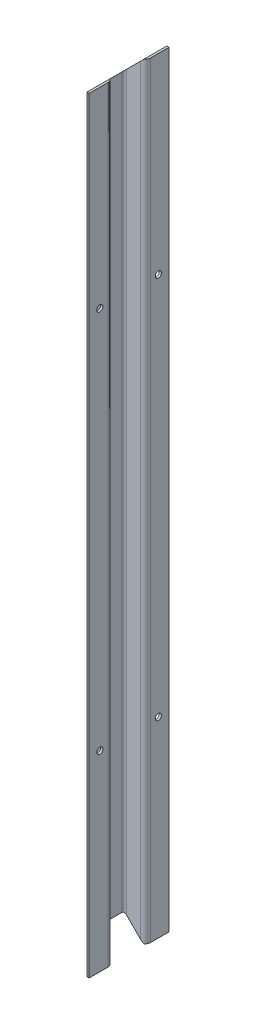
ISO-10303-21;
HEADER;
FILE_DESCRIPTION(('STEP AP214'),'2;1');
FILE_NAME('part.step','',(''),(''),'','','');
FILE_SCHEMA(('AUTOMOTIVE_DESIGN { 1 0 10303 214 1 1 1 1 }'));
ENDSEC;
DATA;
#1=APPLICATION_CONTEXT('core data for automotive mechanical design processes');
#2=APPLICATION_PROTOCOL_DEFINITION('international standard','automotive_design',2000,#1);
#3=PRODUCT_CONTEXT('',#1,'mechanical');
#4=PRODUCT('Part','Part','',(#3));
#5=PRODUCT_RELATED_PRODUCT_CATEGORY('part','',(#4));
#6=PRODUCT_DEFINITION_FORMATION('','',#4);
#7=PRODUCT_DEFINITION_CONTEXT('part definition',#1,'design');
#8=PRODUCT_DEFINITION('design','',#6,#7);
#9=PRODUCT_DEFINITION_SHAPE('','',#8);
#10=(LENGTH_UNIT() NAMED_UNIT(*) SI_UNIT(.MILLI.,.METRE.));
#11=(NAMED_UNIT(*) PLANE_ANGLE_UNIT() SI_UNIT($,.RADIAN.));
#12=(NAMED_UNIT(*) SI_UNIT($,.STERADIAN.) SOLID_ANGLE_UNIT());
#13=UNCERTAINTY_MEASURE_WITH_UNIT(LENGTH_MEASURE(1.E-05),#10,'distance_accuracy_value','');
#14=(GEOMETRIC_REPRESENTATION_CONTEXT(3) GLOBAL_UNCERTAINTY_ASSIGNED_CONTEXT((#13)) GLOBAL_UNIT_ASSIGNED_CONTEXT((#10,
#11,#12)) REPRESENTATION_CONTEXT('',''));
#15=CARTESIAN_POINT('',(0.,0.,0.));
#16=DIRECTION('',(0.,0.,1.));
#17=DIRECTION('',(1.,0.,0.));
#18=AXIS2_PLACEMENT_3D('',#15,#16,#17);
#19=CARTESIAN_POINT('',(12.7,-914.4,-450.975716114044));
#20=DIRECTION('',(0.,0.,1.));
#21=DIRECTION('',(1.,0.,0.));
#22=AXIS2_PLACEMENT_3D('',#19,#20,#21);
#23=PLANE('',#22);
#24=DIRECTION('',(-0.707106781186547,0.707106781186548,0.));
#25=VECTOR('',#24,1.);
#26=CARTESIAN_POINT('',(11.5321843035207,-900.532184303521,-450.975716114044));
#27=LINE('',#26,#25);
#28=CARTESIAN_POINT('',(22.8092,-911.8092,-450.975716114044));
#29=VERTEX_POINT('',#28);
#30=CARTESIAN_POINT('',(5.7658,-894.7658,-450.975716114044));
#31=VERTEX_POINT('',#30);
#32=EDGE_CURVE('E376',#29,#31,#27,.T.);
#33=ORIENTED_EDGE('',*,*,#32,.F.);
#34=DIRECTION('',(0.,1.,0.));
#35=VECTOR('',#34,1.);
#36=CARTESIAN_POINT('',(22.8092,0.,-450.975716114044));
#37=LINE('',#36,#35);
#38=CARTESIAN_POINT('',(22.8092,-2.5908,-450.975716114044));
#39=VERTEX_POINT('',#38);
#40=EDGE_CURVE('E300',#29,#39,#37,.T.);
#41=ORIENTED_EDGE('',*,*,#40,.T.);
#42=DIRECTION('',(-0.707106781186548,-0.707106781186548,0.));
#43=VECTOR('',#42,1.);
#44=CARTESIAN_POINT('',(7.8140222492642,-17.5859777507358,-450.975716114044));
#45=LINE('',#44,#43);
#46=CARTESIAN_POINT('',(5.7658,-19.6342,-450.975716114044));
#47=VERTEX_POINT('',#46);
#48=EDGE_CURVE('E364',#39,#47,#45,.T.);
#49=ORIENTED_EDGE('',*,*,#48,.T.);
#50=DIRECTION('',(0.,1.,0.));
#51=VECTOR('',#50,1.);
#52=CARTESIAN_POINT('',(5.7658,-914.4,-450.975716114044));
#53=LINE('',#52,#51);
#54=EDGE_CURVE('E247',#47,#31,#53,.F.);
#55=ORIENTED_EDGE('',*,*,#54,.T.);
#56=EDGE_LOOP('',(#33,#41,#49,#55));
#57=FACE_BOUND('',#56,.T.);
#58=ADVANCED_FACE('F16',(#57),#23,.T.);
#59=CARTESIAN_POINT('',(0.,-914.4,-473.200716114044));
#60=DIRECTION('',(1.,0.,0.));
#61=DIRECTION('',(0.,0.,-1.));
#62=AXIS2_PLACEMENT_3D('',#59,#60,#61);
#63=PLANE('',#62);
#64=DIRECTION('',(0.,1.,0.));
#65=VECTOR('',#64,1.);
#66=CARTESIAN_POINT('',(0.,0.,-456.741516114044));
#67=LINE('',#66,#65);
#68=CARTESIAN_POINT('',(0.,-889.,-456.741516114044));
#69=VERTEX_POINT('',#68);
#70=CARTESIAN_POINT('',(0.,-25.4,-456.741516114044));
#71=VERTEX_POINT('',#70);
#72=EDGE_CURVE('E484',#69,#71,#67,.T.);
#73=ORIENTED_EDGE('',*,*,#72,.T.);
#74=DIRECTION('',(0.,0.,-1.));
#75=VECTOR('',#74,1.);
#76=CARTESIAN_POINT('',(0.,-25.4,-450.975716114044));
#77=LINE('',#76,#75);
#78=CARTESIAN_POINT('',(0.,-25.4,-489.659916114044));
#79=VERTEX_POINT('',#78);
#80=EDGE_CURVE('E367',#71,#79,#77,.T.);
#81=ORIENTED_EDGE('',*,*,#80,.T.);
#82=DIRECTION('',(0.,1.,0.));
#83=VECTOR('',#82,1.);
#84=CARTESIAN_POINT('',(0.,-914.4,-489.659916114044));
#85=LINE('',#84,#83);
#86=CARTESIAN_POINT('',(0.,-889.,-489.659916114044));
#87=VERTEX_POINT('',#86);
#88=EDGE_CURVE('E480',#79,#87,#85,.F.);
#89=ORIENTED_EDGE('',*,*,#88,.T.);
#90=DIRECTION('',(0.,0.,-1.));
#91=VECTOR('',#90,1.);
#92=CARTESIAN_POINT('',(0.,-889.,-450.975716114044));
#93=LINE('',#92,#91);
#94=EDGE_CURVE('E379',#69,#87,#93,.T.);
#95=ORIENTED_EDGE('',*,*,#94,.F.);
#96=EDGE_LOOP('',(#73,#81,#89,#95));
#97=FACE_BOUND('',#96,.T.);
#98=ADVANCED_FACE('F540',(#97),#63,.F.);
#99=CARTESIAN_POINT('',(12.7,-914.4,-495.425716114044));
#100=DIRECTION('',(0.,0.,1.));
#101=DIRECTION('',(1.,0.,0.));
#102=AXIS2_PLACEMENT_3D('',#99,#100,#101);
#103=PLANE('',#102);
#104=DIRECTION('',(-0.707106781186548,-0.707106781186548,0.));
#105=VECTOR('',#104,1.);
#106=CARTESIAN_POINT('',(7.8140222492642,-17.5859777507358,-495.425716114044));
#107=LINE('',#106,#105);
#108=CARTESIAN_POINT('',(22.8092,-2.5908,-495.425716114044));
#109=VERTEX_POINT('',#108);
#110=CARTESIAN_POINT('',(5.7658,-19.6342,-495.425716114044));
#111=VERTEX_POINT('',#110);
#112=EDGE_CURVE('E237',#109,#111,#107,.T.);
#113=ORIENTED_EDGE('',*,*,#112,.F.);
#114=DIRECTION('',(0.,1.,0.));
#115=VECTOR('',#114,1.);
#116=CARTESIAN_POINT('',(22.8092,-914.4,-495.425716114044));
#117=LINE('',#116,#115);
#118=CARTESIAN_POINT('',(22.8092,-911.8092,-495.425716114044));
#119=VERTEX_POINT('',#118);
#120=EDGE_CURVE('E283',#109,#119,#117,.F.);
#121=ORIENTED_EDGE('',*,*,#120,.T.);
#122=DIRECTION('',(-0.707106781186547,0.707106781186548,0.));
#123=VECTOR('',#122,1.);
#124=CARTESIAN_POINT('',(11.5321843035207,-900.532184303521,-495.425716114044));
#125=LINE('',#124,#123);
#126=CARTESIAN_POINT('',(5.7658,-894.7658,-495.425716114044));
#127=VERTEX_POINT('',#126);
#128=EDGE_CURVE('E333',#119,#127,#125,.T.);
#129=ORIENTED_EDGE('',*,*,#128,.T.);
#130=DIRECTION('',(0.,1.,0.));
#131=VECTOR('',#130,1.);
#132=CARTESIAN_POINT('',(5.7658,-914.4,-495.425716114044));
#133=LINE('',#132,#131);
#134=EDGE_CURVE('E254',#127,#111,#133,.T.);
#135=ORIENTED_EDGE('',*,*,#134,.T.);
#136=EDGE_LOOP('',(#113,#121,#129,#135));
#137=FACE_BOUND('',#136,.T.);
#138=ADVANCED_FACE('F531',(#137),#103,.F.);
#139=CARTESIAN_POINT('',(26.6954,-914.4,-492.824756114044));
#140=DIRECTION('',(0.,0.,1.));
#141=DIRECTION('',(1.,0.,0.));
#142=AXIS2_PLACEMENT_3D('',#139,#140,#141);
#143=PLANE('',#142);
#144=DIRECTION('',(0.707106781186548,0.707106781186547,0.));
#145=VECTOR('',#144,1.);
#146=CARTESIAN_POINT('',(-431.1523,-456.5523,-492.824756114044));
#147=LINE('',#146,#145);
#148=CARTESIAN_POINT('',(5.19175999999988,-20.20824,-492.824756114044));
#149=VERTEX_POINT('',#148);
#150=CARTESIAN_POINT('',(22.225,-3.17499999999988,-492.824756114044));
#151=VERTEX_POINT('',#150);
#152=EDGE_CURVE('E412',#149,#151,#147,.T.);
#153=ORIENTED_EDGE('',*,*,#152,.F.);
#154=DIRECTION('',(0.,1.,0.));
#155=VECTOR('',#154,1.);
#156=CARTESIAN_POINT('',(5.19176,-891.60096,-492.824756114044));
#157=LINE('',#156,#155);
#158=CARTESIAN_POINT('',(5.19176,-894.19176,-492.824756114044));
#159=VERTEX_POINT('',#158);
#160=EDGE_CURVE('E293',#149,#159,#157,.F.);
#161=ORIENTED_EDGE('',*,*,#160,.T.);
#162=DIRECTION('',(0.707106781186547,-0.707106781186548,0.));
#163=VECTOR('',#162,1.);
#164=CARTESIAN_POINT('',(26.0477,-915.0477,-492.824756114044));
#165=LINE('',#164,#163);
#166=CARTESIAN_POINT('',(22.225,-911.225,-492.824756114044));
#167=VERTEX_POINT('',#166);
#168=EDGE_CURVE('E390',#159,#167,#165,.T.);
#169=ORIENTED_EDGE('',*,*,#168,.T.);
#170=DIRECTION('',(0.,1.,0.));
#171=VECTOR('',#170,1.);
#172=CARTESIAN_POINT('',(22.225,-914.4,-492.824756114044));
#173=LINE('',#172,#171);
#174=EDGE_CURVE('E265',#167,#151,#173,.T.);
#175=ORIENTED_EDGE('',*,*,#174,.T.);
#176=EDGE_LOOP('',(#153,#161,#169,#175));
#177=FACE_BOUND('',#176,.T.);
#178=ADVANCED_FACE('F907',(#177),#143,.T.);
#179=CARTESIAN_POINT('',(2.60096,-914.4,-473.200716114044));
#180=DIRECTION('',(1.,0.,0.));
#181=DIRECTION('',(0.,0.,-1.));
#182=AXIS2_PLACEMENT_3D('',#179,#180,#181);
#183=PLANE('',#182);
#184=DIRECTION('',(0.,0.,-1.));
#185=VECTOR('',#184,1.);
#186=CARTESIAN_POINT('',(2.60096,-891.60096,-473.200716114044));
#187=LINE('',#186,#185);
#188=CARTESIAN_POINT('',(2.60096,-891.60096,-456.167476114044));
#189=VERTEX_POINT('',#188);
#190=CARTESIAN_POINT('',(2.60096,-891.60096,-490.233956114044));
#191=VERTEX_POINT('',#190);
#192=EDGE_CURVE('E386',#189,#191,#187,.T.);
#193=ORIENTED_EDGE('',*,*,#192,.T.);
#194=DIRECTION('',(0.,1.,0.));
#195=VECTOR('',#194,1.);
#196=CARTESIAN_POINT('',(2.60096,-22.79904,-490.233956114044));
#197=LINE('',#196,#195);
#198=CARTESIAN_POINT('',(2.60096,-22.79904,-490.233956114044));
#199=VERTEX_POINT('',#198);
#200=EDGE_CURVE('E289',#191,#199,#197,.T.);
#201=ORIENTED_EDGE('',*,*,#200,.T.);
#202=DIRECTION('',(0.,0.,-1.));
#203=VECTOR('',#202,1.);
#204=CARTESIAN_POINT('',(2.60096,-22.79904,-473.200716114044));
#205=LINE('',#204,#203);
#206=CARTESIAN_POINT('',(2.60096,-22.79904,-456.167476114044));
#207=VERTEX_POINT('',#206);
#208=EDGE_CURVE('E408',#207,#199,#205,.T.);
#209=ORIENTED_EDGE('',*,*,#208,.F.);
#210=DIRECTION('',(0.,1.,0.));
#211=VECTOR('',#210,1.);
#212=CARTESIAN_POINT('',(2.60096,-914.4,-456.167476114044));
#213=LINE('',#212,#211);
#214=EDGE_CURVE('E286',#207,#189,#213,.F.);
#215=ORIENTED_EDGE('',*,*,#214,.T.);
#216=EDGE_LOOP('',(#193,#201,#209,#215));
#217=FACE_BOUND('',#216,.T.);
#218=ADVANCED_FACE('F895',(#217),#183,.T.);
#219=CARTESIAN_POINT('',(14.00048,-914.4,-453.576676114044));
#220=DIRECTION('',(0.,0.,1.));
#221=DIRECTION('',(1.,0.,0.));
#222=AXIS2_PLACEMENT_3D('',#219,#220,#221);
#223=PLANE('',#222);
#224=DIRECTION('',(0.707106781186547,-0.707106781186548,0.));
#225=VECTOR('',#224,1.);
#226=CARTESIAN_POINT('',(19.70024,-908.70024,-453.576676114044));
#227=LINE('',#226,#225);
#228=CARTESIAN_POINT('',(5.19176,-894.19176,-453.576676114044));
#229=VERTEX_POINT('',#228);
#230=CARTESIAN_POINT('',(22.225,-911.225,-453.576676114044));
#231=VERTEX_POINT('',#230);
#232=EDGE_CURVE('E218',#229,#231,#227,.T.);
#233=ORIENTED_EDGE('',*,*,#232,.F.);
#234=DIRECTION('',(0.,1.,0.));
#235=VECTOR('',#234,1.);
#236=CARTESIAN_POINT('',(5.19176,-914.4,-453.576676114044));
#237=LINE('',#236,#235);
#238=CARTESIAN_POINT('',(5.19175999999988,-20.20824,-453.576676114044));
#239=VERTEX_POINT('',#238);
#240=EDGE_CURVE('E296',#229,#239,#237,.T.);
#241=ORIENTED_EDGE('',*,*,#240,.T.);
#242=DIRECTION('',(0.707106781186548,0.707106781186547,0.));
#243=VECTOR('',#242,1.);
#244=CARTESIAN_POINT('',(-437.49976,-462.89976,-453.576676114044));
#245=LINE('',#244,#243);
#246=CARTESIAN_POINT('',(22.225,-3.17499999999982,-453.576676114044));
#247=VERTEX_POINT('',#246);
#248=EDGE_CURVE('E405',#239,#247,#245,.T.);
#249=ORIENTED_EDGE('',*,*,#248,.T.);
#250=DIRECTION('',(0.,1.,0.));
#251=VECTOR('',#250,1.);
#252=CARTESIAN_POINT('',(22.225,-914.4,-453.576676114044));
#253=LINE('',#252,#251);
#254=EDGE_CURVE('E225',#247,#231,#253,.F.);
#255=ORIENTED_EDGE('',*,*,#254,.T.);
#256=EDGE_LOOP('',(#233,#241,#249,#255));
#257=FACE_BOUND('',#256,.T.);
#258=ADVANCED_FACE('F886',(#257),#223,.F.);
#259=CARTESIAN_POINT('',(13.9954,-914.4,-473.200716114044));
#260=DIRECTION('',(0.,-1.,0.));
#261=DIRECTION('',(1.,0.,0.));
#262=AXIS2_PLACEMENT_3D('',#259,#260,#261);
#263=PLANE('',#262);
#264=DIRECTION('',(0.,0.,1.));
#265=VECTOR('',#264,1.);
#266=CARTESIAN_POINT('',(25.4,-914.4,-438.275716114044));
#267=LINE('',#266,#265);
#268=CARTESIAN_POINT('',(25.4,-914.4,-448.384916114044));
#269=VERTEX_POINT('',#268);
#270=CARTESIAN_POINT('',(25.4,-914.4,-425.575716114044));
#271=VERTEX_POINT('',#270);
#272=EDGE_CURVE('E234',#269,#271,#267,.T.);
#273=ORIENTED_EDGE('',*,*,#272,.F.);
#274=DIRECTION('',(0.,0.,-1.));
#275=VECTOR('',#274,1.);
#276=CARTESIAN_POINT('',(25.4,-914.4,-450.975716114044));
#277=LINE('',#276,#275);
#278=CARTESIAN_POINT('',(25.4,-914.4,-452.623757230382));
#279=VERTEX_POINT('',#278);
#280=EDGE_CURVE('E215',#269,#279,#277,.T.);
#281=ORIENTED_EDGE('',*,*,#280,.T.);
#282=CARTESIAN_POINT('',(22.225,-914.4,-447.810876114044));
#283=DIRECTION('',(0.,-1.,0.));
#284=DIRECTION('',(0.,0.,-1.));
#285=AXIS2_PLACEMENT_3D('',#282,#283,#284);
#286=CIRCLE('',#285,5.7658);
#287=CARTESIAN_POINT('',(27.9908,-914.4,-447.810876114044));
#288=VERTEX_POINT('',#287);
#289=EDGE_CURVE('E231',#279,#288,#286,.T.);
#290=ORIENTED_EDGE('',*,*,#289,.T.);
#291=DIRECTION('',(0.,0.,-1.));
#292=VECTOR('',#291,1.);
#293=CARTESIAN_POINT('',(27.9908,-914.4,-439.576196114044));
#294=LINE('',#293,#292);
#295=CARTESIAN_POINT('',(27.9908,-914.4,-425.575716114044));
#296=VERTEX_POINT('',#295);
#297=EDGE_CURVE('E438',#296,#288,#294,.T.);
#298=ORIENTED_EDGE('',*,*,#297,.F.);
#299=DIRECTION('',(1.,0.,0.));
#300=VECTOR('',#299,1.);
#301=CARTESIAN_POINT('',(26.6954,-914.4,-425.575716114044));
#302=LINE('',#301,#300);
#303=EDGE_CURVE('E441',#271,#296,#302,.T.);
#304=ORIENTED_EDGE('',*,*,#303,.F.);
#305=EDGE_LOOP('',(#273,#281,#290,#298,#304));
#306=FACE_BOUND('',#305,.T.);
#307=ADVANCED_FACE('F229',(#306),#263,.T.);
#308=CARTESIAN_POINT('',(22.225,-914.4,-498.590556114044));
#309=DIRECTION('',(0.,-1.,0.));
#310=DIRECTION('',(0.,0.,-1.));
#311=AXIS2_PLACEMENT_3D('',#308,#309,#310);
#312=CIRCLE('',#311,5.7658);
#313=CARTESIAN_POINT('',(27.9908,-914.4,-498.590556114044));
#314=VERTEX_POINT('',#313);
#315=CARTESIAN_POINT('',(25.4,-914.4,-493.777674997707));
#316=VERTEX_POINT('',#315);
#317=EDGE_CURVE('E246',#314,#316,#312,.T.);
#318=ORIENTED_EDGE('',*,*,#317,.T.);
#319=CARTESIAN_POINT('',(25.4,-914.4,-498.016516114044));
#320=VERTEX_POINT('',#319);
#321=EDGE_CURVE('E238',#316,#320,#277,.T.);
#322=ORIENTED_EDGE('',*,*,#321,.T.);
#323=DIRECTION('',(0.,0.,1.));
#324=VECTOR('',#323,1.);
#325=CARTESIAN_POINT('',(25.4,-914.4,-508.125716114044));
#326=LINE('',#325,#324);
#327=CARTESIAN_POINT('',(25.4,-914.4,-520.825716114044));
#328=VERTEX_POINT('',#327);
#329=EDGE_CURVE('E426',#328,#320,#326,.T.);
#330=ORIENTED_EDGE('',*,*,#329,.F.);
#331=DIRECTION('',(-1.,0.,0.));
#332=VECTOR('',#331,1.);
#333=CARTESIAN_POINT('',(26.6954,-914.4,-520.825716114044));
#334=LINE('',#333,#332);
#335=CARTESIAN_POINT('',(27.9908,-914.4,-520.825716114044));
#336=VERTEX_POINT('',#335);
#337=EDGE_CURVE('E430',#336,#328,#334,.T.);
#338=ORIENTED_EDGE('',*,*,#337,.F.);
#339=DIRECTION('',(0.,0.,-1.));
#340=VECTOR('',#339,1.);
#341=CARTESIAN_POINT('',(27.9908,-914.4,-506.825236114044));
#342=LINE('',#341,#340);
#343=EDGE_CURVE('E435',#314,#336,#342,.T.);
#344=ORIENTED_EDGE('',*,*,#343,.F.);
#345=EDGE_LOOP('',(#318,#322,#330,#338,#344));
#346=FACE_BOUND('',#345,.T.);
#347=ADVANCED_FACE('F512',(#346),#263,.T.);
#348=CARTESIAN_POINT('',(13.9954,0.,-473.200716114044));
#349=DIRECTION('',(0.,-1.,0.));
#350=DIRECTION('',(1.,0.,0.));
#351=AXIS2_PLACEMENT_3D('',#348,#349,#350);
#352=PLANE('',#351);
#353=DIRECTION('',(0.,0.,-1.));
#354=VECTOR('',#353,1.);
#355=CARTESIAN_POINT('',(25.4,0.,-450.975716114044));
#356=LINE('',#355,#354);
#357=CARTESIAN_POINT('',(25.4,0.,-448.384916114044));
#358=VERTEX_POINT('',#357);
#359=CARTESIAN_POINT('',(25.4,0.,-452.623757230382));
#360=VERTEX_POINT('',#359);
#361=EDGE_CURVE('E40',#358,#360,#356,.T.);
#362=ORIENTED_EDGE('',*,*,#361,.F.);
#363=DIRECTION('',(0.,0.,1.));
#364=VECTOR('',#363,1.);
#365=CARTESIAN_POINT('',(25.4,0.,-438.275716114044));
#366=LINE('',#365,#364);
#367=CARTESIAN_POINT('',(25.4,0.,-425.575716114044));
#368=VERTEX_POINT('',#367);
#369=EDGE_CURVE('E431',#358,#368,#366,.T.);
#370=ORIENTED_EDGE('',*,*,#369,.T.);
#371=DIRECTION('',(1.,0.,0.));
#372=VECTOR('',#371,1.);
#373=CARTESIAN_POINT('',(26.6954,0.,-425.575716114044));
#374=LINE('',#373,#372);
#375=CARTESIAN_POINT('',(27.9908,0.,-425.575716114044));
#376=VERTEX_POINT('',#375);
#377=EDGE_CURVE('E461',#368,#376,#374,.T.);
#378=ORIENTED_EDGE('',*,*,#377,.T.);
#379=DIRECTION('',(0.,0.,-1.));
#380=VECTOR('',#379,1.);
#381=CARTESIAN_POINT('',(27.9908,0.,-439.576196114044));
#382=LINE('',#381,#380);
#383=CARTESIAN_POINT('',(27.9908,0.,-447.810876114044));
#384=VERTEX_POINT('',#383);
#385=EDGE_CURVE('E457',#376,#384,#382,.T.);
#386=ORIENTED_EDGE('',*,*,#385,.T.);
#387=CARTESIAN_POINT('',(22.225,0.,-447.810876114044));
#388=DIRECTION('',(0.,-1.,0.));
#389=DIRECTION('',(0.,0.,-1.));
#390=AXIS2_PLACEMENT_3D('',#387,#388,#389);
#391=CIRCLE('',#390,5.7658);
#392=EDGE_CURVE('E488',#384,#360,#391,.F.);
#393=ORIENTED_EDGE('',*,*,#392,.T.);
#394=EDGE_LOOP('',(#362,#370,#378,#386,#393));
#395=FACE_BOUND('',#394,.T.);
#396=ADVANCED_FACE('F857',(#395),#352,.F.);
#397=CARTESIAN_POINT('',(25.4,0.,-493.777674997706));
#398=VERTEX_POINT('',#397);
#399=CARTESIAN_POINT('',(25.4,0.,-498.016516114044));
#400=VERTEX_POINT('',#399);
#401=EDGE_CURVE('E373',#398,#400,#356,.T.);
#402=ORIENTED_EDGE('',*,*,#401,.F.);
#403=CARTESIAN_POINT('',(22.225,0.,-498.590556114044));
#404=DIRECTION('',(0.,-1.,0.));
#405=DIRECTION('',(0.,0.,-1.));
#406=AXIS2_PLACEMENT_3D('',#403,#404,#405);
#407=CIRCLE('',#406,5.7658);
#408=CARTESIAN_POINT('',(27.9908,0.,-498.590556114044));
#409=VERTEX_POINT('',#408);
#410=EDGE_CURVE('E258',#398,#409,#407,.F.);
#411=ORIENTED_EDGE('',*,*,#410,.T.);
#412=DIRECTION('',(0.,0.,-1.));
#413=VECTOR('',#412,1.);
#414=CARTESIAN_POINT('',(27.9908,0.,-506.825236114044));
#415=LINE('',#414,#413);
#416=CARTESIAN_POINT('',(27.9908,0.,-520.825716114044));
#417=VERTEX_POINT('',#416);
#418=EDGE_CURVE('E454',#409,#417,#415,.T.);
#419=ORIENTED_EDGE('',*,*,#418,.T.);
#420=DIRECTION('',(-1.,0.,0.));
#421=VECTOR('',#420,1.);
#422=CARTESIAN_POINT('',(26.6954,0.,-520.825716114044));
#423=LINE('',#422,#421);
#424=CARTESIAN_POINT('',(25.4,0.,-520.825716114044));
#425=VERTEX_POINT('',#424);
#426=EDGE_CURVE('E450',#417,#425,#423,.T.);
#427=ORIENTED_EDGE('',*,*,#426,.T.);
#428=DIRECTION('',(0.,0.,1.));
#429=VECTOR('',#428,1.);
#430=CARTESIAN_POINT('',(25.4,0.,-508.125716114044));
#431=LINE('',#430,#429);
#432=EDGE_CURVE('E425',#425,#400,#431,.T.);
#433=ORIENTED_EDGE('',*,*,#432,.T.);
#434=EDGE_LOOP('',(#402,#411,#419,#427,#433));
#435=FACE_BOUND('',#434,.T.);
#436=ADVANCED_FACE('F498',(#435),#352,.F.);
#437=CARTESIAN_POINT('',(5.7658,-914.4,-456.741516114044));
#438=DIRECTION('',(0.,-1.,0.));
#439=DIRECTION('',(0.,0.,-1.));
#440=AXIS2_PLACEMENT_3D('',#437,#438,#439);
#441=CYLINDRICAL_SURFACE('',#440,5.7658);
#442=CARTESIAN_POINT('',(5.7658,-19.6342,-456.741516114044));
#443=DIRECTION('',(0.707106781186547,-0.707106781186548,0.));
#444=DIRECTION('',(-0.707106781186548,-0.707106781186548,0.));
#445=AXIS2_PLACEMENT_3D('',#442,#443,#444);
#446=ELLIPSE('',#445,8.15407255793079,5.7658);
#447=EDGE_CURVE('E421',#71,#47,#446,.F.);
#448=ORIENTED_EDGE('',*,*,#447,.F.);
#449=ORIENTED_EDGE('',*,*,#72,.F.);
#450=CARTESIAN_POINT('',(5.7658,-894.7658,-456.741516114044));
#451=DIRECTION('',(-0.707106781186548,-0.707106781186547,0.));
#452=DIRECTION('',(0.707106781186547,-0.707106781186548,0.));
#453=AXIS2_PLACEMENT_3D('',#450,#451,#452);
#454=ELLIPSE('',#453,8.1540725579308,5.7658);
#455=EDGE_CURVE('E401',#69,#31,#454,.F.);
#456=ORIENTED_EDGE('',*,*,#455,.T.);
#457=ORIENTED_EDGE('',*,*,#54,.F.);
#458=EDGE_LOOP('',(#448,#449,#456,#457));
#459=FACE_BOUND('',#458,.T.);
#460=ADVANCED_FACE('F544',(#459),#441,.T.);
#461=CARTESIAN_POINT('',(5.7658,-914.4,-489.659916114044));
#462=DIRECTION('',(0.,1.,0.));
#463=DIRECTION('',(0.,0.,1.));
#464=AXIS2_PLACEMENT_3D('',#461,#462,#463);
#465=CYLINDRICAL_SURFACE('',#464,5.7658);
#466=CARTESIAN_POINT('',(5.7658,-19.6342,-489.659916114044));
#467=DIRECTION('',(0.707106781186547,-0.707106781186548,0.));
#468=DIRECTION('',(0.707106781186548,0.707106781186548,0.));
#469=AXIS2_PLACEMENT_3D('',#466,#467,#468);
#470=ELLIPSE('',#469,8.15407255793079,5.7658);
#471=EDGE_CURVE('E418',#111,#79,#470,.F.);
#472=ORIENTED_EDGE('',*,*,#471,.F.);
#473=ORIENTED_EDGE('',*,*,#134,.F.);
#474=CARTESIAN_POINT('',(5.7658,-894.7658,-489.659916114044));
#475=DIRECTION('',(-0.707106781186548,-0.707106781186547,0.));
#476=DIRECTION('',(-0.707106781186547,0.707106781186548,0.));
#477=AXIS2_PLACEMENT_3D('',#474,#475,#476);
#478=ELLIPSE('',#477,8.1540725579308,5.7658);
#479=EDGE_CURVE('E397',#127,#87,#478,.F.);
#480=ORIENTED_EDGE('',*,*,#479,.T.);
#481=ORIENTED_EDGE('',*,*,#88,.F.);
#482=EDGE_LOOP('',(#472,#473,#480,#481));
#483=FACE_BOUND('',#482,.T.);
#484=ADVANCED_FACE('F536',(#483),#465,.T.);
#485=CARTESIAN_POINT('',(22.225,-914.4,-498.590556114044));
#486=DIRECTION('',(0.,1.,0.));
#487=DIRECTION('',(0.,0.,1.));
#488=AXIS2_PLACEMENT_3D('',#485,#486,#487);
#489=CYLINDRICAL_SURFACE('',#488,5.7658);
#490=CARTESIAN_POINT('',(22.225,-3.17499999999982,-498.590556114044));
#491=DIRECTION('',(0.707106781186547,-0.707106781186548,0.));
#492=DIRECTION('',(0.707106781186548,0.707106781186548,0.));
#493=AXIS2_PLACEMENT_3D('',#490,#491,#492);
#494=ELLIPSE('',#493,8.15407255793079,5.7658);
#495=EDGE_CURVE('E415',#151,#398,#494,.F.);
#496=ORIENTED_EDGE('',*,*,#495,.F.);
#497=ORIENTED_EDGE('',*,*,#174,.F.);
#498=CARTESIAN_POINT('',(22.225,-911.225,-498.590556114044));
#499=DIRECTION('',(-0.707106781186548,-0.707106781186547,0.));
#500=DIRECTION('',(-0.707106781186547,0.707106781186548,0.));
#501=AXIS2_PLACEMENT_3D('',#498,#499,#500);
#502=ELLIPSE('',#501,8.1540725579308,5.7658);
#503=EDGE_CURVE('E393',#167,#316,#502,.F.);
#504=ORIENTED_EDGE('',*,*,#503,.T.);
#505=ORIENTED_EDGE('',*,*,#317,.F.);
#506=DIRECTION('',(0.,1.,0.));
#507=VECTOR('',#506,1.);
#508=CARTESIAN_POINT('',(27.9908,-914.4,-498.590556114044));
#509=LINE('',#508,#507);
#510=EDGE_CURVE('E269',#409,#314,#509,.F.);
#511=ORIENTED_EDGE('',*,*,#510,.F.);
#512=ORIENTED_EDGE('',*,*,#410,.F.);
#513=EDGE_LOOP('',(#496,#497,#504,#505,#511,#512));
#514=FACE_BOUND('',#513,.T.);
#515=ADVANCED_FACE('F508',(#514),#489,.T.);
#516=CARTESIAN_POINT('',(22.225,-914.4,-447.810876114044));
#517=DIRECTION('',(0.,-1.,0.));
#518=DIRECTION('',(0.,0.,-1.));
#519=AXIS2_PLACEMENT_3D('',#516,#517,#518);
#520=CYLINDRICAL_SURFACE('',#519,5.7658);
#521=CARTESIAN_POINT('',(22.225,-3.17499999999982,-447.810876114044));
#522=DIRECTION('',(0.707106781186547,-0.707106781186548,0.));
#523=DIRECTION('',(-0.707106781186548,-0.707106781186548,0.));
#524=AXIS2_PLACEMENT_3D('',#521,#522,#523);
#525=ELLIPSE('',#524,8.15407255793079,5.7658);
#526=EDGE_CURVE('E224',#360,#247,#525,.F.);
#527=ORIENTED_EDGE('',*,*,#526,.F.);
#528=ORIENTED_EDGE('',*,*,#392,.F.);
#529=DIRECTION('',(0.,1.,0.));
#530=VECTOR('',#529,1.);
#531=CARTESIAN_POINT('',(27.9908,0.,-447.810876114044));
#532=LINE('',#531,#530);
#533=EDGE_CURVE('E244',#288,#384,#532,.T.);
#534=ORIENTED_EDGE('',*,*,#533,.F.);
#535=ORIENTED_EDGE('',*,*,#289,.F.);
#536=CARTESIAN_POINT('',(22.225,-911.225,-447.810876114044));
#537=DIRECTION('',(-0.707106781186548,-0.707106781186547,0.));
#538=DIRECTION('',(0.707106781186547,-0.707106781186548,0.));
#539=AXIS2_PLACEMENT_3D('',#536,#537,#538);
#540=ELLIPSE('',#539,8.1540725579308,5.7658);
#541=EDGE_CURVE('E212',#279,#231,#540,.F.);
#542=ORIENTED_EDGE('',*,*,#541,.T.);
#543=ORIENTED_EDGE('',*,*,#254,.F.);
#544=EDGE_LOOP('',(#527,#528,#534,#535,#542,#543));
#545=FACE_BOUND('',#544,.T.);
#546=ADVANCED_FACE('F242',(#545),#520,.T.);
#547=CARTESIAN_POINT('',(25.4,-914.4,-508.125716114044));
#548=DIRECTION('',(-1.,0.,0.));
#549=DIRECTION('',(0.,0.,1.));
#550=AXIS2_PLACEMENT_3D('',#547,#548,#549);
#551=PLANE('',#550);
#552=CARTESIAN_POINT('',(25.4,-228.6,-508.125716114044));
#553=DIRECTION('',(-1.,0.,0.));
#554=DIRECTION('',(0.,0.,1.));
#555=AXIS2_PLACEMENT_3D('',#552,#553,#554);
#556=CIRCLE('',#555,3.683);
#557=CARTESIAN_POINT('',(25.4,-228.6,-504.442716114044));
#558=VERTEX_POINT('',#557);
#559=EDGE_CURVE('E339',#558,#558,#556,.F.);
#560=ORIENTED_EDGE('',*,*,#559,.T.);
#561=EDGE_LOOP('',(#560));
#562=FACE_BOUND('',#561,.T.);
#563=CARTESIAN_POINT('',(25.4,-685.8,-508.125716114044));
#564=DIRECTION('',(-1.,0.,0.));
#565=DIRECTION('',(0.,0.,1.));
#566=AXIS2_PLACEMENT_3D('',#563,#564,#565);
#567=CIRCLE('',#566,3.683);
#568=CARTESIAN_POINT('',(25.4,-685.8,-504.442716114044));
#569=VERTEX_POINT('',#568);
#570=EDGE_CURVE('E335',#569,#569,#567,.F.);
#571=ORIENTED_EDGE('',*,*,#570,.T.);
#572=EDGE_LOOP('',(#571));
#573=FACE_BOUND('',#572,.T.);
#574=ORIENTED_EDGE('',*,*,#329,.T.);
#575=DIRECTION('',(0.,1.,0.));
#576=VECTOR('',#575,1.);
#577=CARTESIAN_POINT('',(25.4,-914.4,-498.016516114044));
#578=LINE('',#577,#576);
#579=EDGE_CURVE('E279',#320,#400,#578,.T.);
#580=ORIENTED_EDGE('',*,*,#579,.T.);
#581=ORIENTED_EDGE('',*,*,#432,.F.);
#582=DIRECTION('',(0.,1.,0.));
#583=VECTOR('',#582,1.);
#584=CARTESIAN_POINT('',(25.4,-914.4,-520.825716114044));
#585=LINE('',#584,#583);
#586=EDGE_CURVE('E477',#328,#425,#585,.T.);
#587=ORIENTED_EDGE('',*,*,#586,.F.);
#588=EDGE_LOOP('',(#574,#580,#581,#587));
#589=FACE_BOUND('',#588,.T.);
#590=ADVANCED_FACE('F519',(#562,#573,#589),#551,.T.);
#591=CARTESIAN_POINT('',(26.6954,-914.4,-520.825716114044));
#592=DIRECTION('',(0.,0.,-1.));
#593=DIRECTION('',(-1.,0.,0.));
#594=AXIS2_PLACEMENT_3D('',#591,#592,#593);
#595=PLANE('',#594);
#596=ORIENTED_EDGE('',*,*,#426,.F.);
#597=DIRECTION('',(0.,1.,0.));
#598=VECTOR('',#597,1.);
#599=CARTESIAN_POINT('',(27.9908,-914.4,-520.825716114044));
#600=LINE('',#599,#598);
#601=EDGE_CURVE('E473',#336,#417,#600,.T.);
#602=ORIENTED_EDGE('',*,*,#601,.F.);
#603=ORIENTED_EDGE('',*,*,#337,.T.);
#604=ORIENTED_EDGE('',*,*,#586,.T.);
#605=EDGE_LOOP('',(#596,#602,#603,#604));
#606=FACE_BOUND('',#605,.T.);
#607=ADVANCED_FACE('F516',(#606),#595,.T.);
#608=CARTESIAN_POINT('',(27.9908,-914.4,-506.825236114044));
#609=DIRECTION('',(1.,0.,0.));
#610=DIRECTION('',(0.,0.,-1.));
#611=AXIS2_PLACEMENT_3D('',#608,#609,#610);
#612=PLANE('',#611);
#613=CARTESIAN_POINT('',(27.9908,-228.6,-508.125716114044));
#614=DIRECTION('',(1.,0.,0.));
#615=DIRECTION('',(0.,0.,-1.));
#616=AXIS2_PLACEMENT_3D('',#613,#614,#615);
#617=CIRCLE('',#616,3.683);
#618=CARTESIAN_POINT('',(27.9908,-228.6,-511.808716114044));
#619=VERTEX_POINT('',#618);
#620=EDGE_CURVE('E342',#619,#619,#617,.T.);
#621=ORIENTED_EDGE('',*,*,#620,.F.);
#622=EDGE_LOOP('',(#621));
#623=FACE_BOUND('',#622,.T.);
#624=CARTESIAN_POINT('',(27.9908,-685.8,-508.125716114044));
#625=DIRECTION('',(1.,0.,0.));
#626=DIRECTION('',(0.,0.,-1.));
#627=AXIS2_PLACEMENT_3D('',#624,#625,#626);
#628=CIRCLE('',#627,3.683);
#629=CARTESIAN_POINT('',(27.9908,-685.8,-511.808716114044));
#630=VERTEX_POINT('',#629);
#631=EDGE_CURVE('E338',#630,#630,#628,.T.);
#632=ORIENTED_EDGE('',*,*,#631,.F.);
#633=EDGE_LOOP('',(#632));
#634=FACE_BOUND('',#633,.T.);
#635=ORIENTED_EDGE('',*,*,#418,.F.);
#636=ORIENTED_EDGE('',*,*,#510,.T.);
#637=ORIENTED_EDGE('',*,*,#343,.T.);
#638=ORIENTED_EDGE('',*,*,#601,.T.);
#639=EDGE_LOOP('',(#635,#636,#637,#638));
#640=FACE_BOUND('',#639,.T.);
#641=ADVANCED_FACE('F503',(#623,#634,#640),#612,.T.);
#642=CARTESIAN_POINT('',(27.9908,-914.4,-439.576196114044));
#643=DIRECTION('',(1.,0.,0.));
#644=DIRECTION('',(0.,0.,-1.));
#645=AXIS2_PLACEMENT_3D('',#642,#643,#644);
#646=PLANE('',#645);
#647=CARTESIAN_POINT('',(27.9908,-228.6,-438.275716114044));
#648=DIRECTION('',(1.,0.,0.));
#649=DIRECTION('',(0.,0.,-1.));
#650=AXIS2_PLACEMENT_3D('',#647,#648,#649);
#651=CIRCLE('',#650,3.683);
#652=CARTESIAN_POINT('',(27.9908,-228.6,-441.958716114044));
#653=VERTEX_POINT('',#652);
#654=EDGE_CURVE('E358',#653,#653,#651,.T.);
#655=ORIENTED_EDGE('',*,*,#654,.F.);
#656=EDGE_LOOP('',(#655));
#657=FACE_BOUND('',#656,.T.);
#658=CARTESIAN_POINT('',(27.9908,-685.8,-438.275716114044));
#659=DIRECTION('',(1.,0.,0.));
#660=DIRECTION('',(0.,0.,-1.));
#661=AXIS2_PLACEMENT_3D('',#658,#659,#660);
#662=CIRCLE('',#661,3.683);
#663=CARTESIAN_POINT('',(27.9908,-685.8,-441.958716114044));
#664=VERTEX_POINT('',#663);
#665=EDGE_CURVE('E334',#664,#664,#662,.T.);
#666=ORIENTED_EDGE('',*,*,#665,.F.);
#667=EDGE_LOOP('',(#666));
#668=FACE_BOUND('',#667,.T.);
#669=ORIENTED_EDGE('',*,*,#297,.T.);
#670=ORIENTED_EDGE('',*,*,#533,.T.);
#671=ORIENTED_EDGE('',*,*,#385,.F.);
#672=DIRECTION('',(0.,1.,0.));
#673=VECTOR('',#672,1.);
#674=CARTESIAN_POINT('',(27.9908,-914.4,-425.575716114044));
#675=LINE('',#674,#673);
#676=EDGE_CURVE('E470',#296,#376,#675,.T.);
#677=ORIENTED_EDGE('',*,*,#676,.F.);
#678=EDGE_LOOP('',(#669,#670,#671,#677));
#679=FACE_BOUND('',#678,.T.);
#680=ADVANCED_FACE('F593',(#657,#668,#679),#646,.T.);
#681=CARTESIAN_POINT('',(26.6954,-914.4,-425.575716114044));
#682=DIRECTION('',(0.,0.,1.));
#683=DIRECTION('',(1.,0.,0.));
#684=AXIS2_PLACEMENT_3D('',#681,#682,#683);
#685=PLANE('',#684);
#686=ORIENTED_EDGE('',*,*,#377,.F.);
#687=DIRECTION('',(0.,1.,0.));
#688=VECTOR('',#687,1.);
#689=CARTESIAN_POINT('',(25.4,-914.4,-425.575716114044));
#690=LINE('',#689,#688);
#691=EDGE_CURVE('E446',#271,#368,#690,.T.);
#692=ORIENTED_EDGE('',*,*,#691,.F.);
#693=ORIENTED_EDGE('',*,*,#303,.T.);
#694=ORIENTED_EDGE('',*,*,#676,.T.);
#695=EDGE_LOOP('',(#686,#692,#693,#694));
#696=FACE_BOUND('',#695,.T.);
#697=ADVANCED_FACE('F588',(#696),#685,.T.);
#698=CARTESIAN_POINT('',(25.4,-914.4,-438.275716114044));
#699=DIRECTION('',(-1.,0.,0.));
#700=DIRECTION('',(0.,0.,1.));
#701=AXIS2_PLACEMENT_3D('',#698,#699,#700);
#702=PLANE('',#701);
#703=CARTESIAN_POINT('',(25.4,-228.6,-438.275716114044));
#704=DIRECTION('',(-1.,0.,0.));
#705=DIRECTION('',(0.,0.,1.));
#706=AXIS2_PLACEMENT_3D('',#703,#704,#705);
#707=CIRCLE('',#706,3.683);
#708=CARTESIAN_POINT('',(25.4,-228.6,-434.592716114044));
#709=VERTEX_POINT('',#708);
#710=EDGE_CURVE('E20',#709,#709,#707,.F.);
#711=ORIENTED_EDGE('',*,*,#710,.T.);
#712=EDGE_LOOP('',(#711));
#713=FACE_BOUND('',#712,.T.);
#714=CARTESIAN_POINT('',(25.4,-685.8,-438.275716114044));
#715=DIRECTION('',(-1.,0.,0.));
#716=DIRECTION('',(0.,0.,1.));
#717=AXIS2_PLACEMENT_3D('',#714,#715,#716);
#718=CIRCLE('',#717,3.683);
#719=CARTESIAN_POINT('',(25.4,-685.8,-434.592716114044));
#720=VERTEX_POINT('',#719);
#721=EDGE_CURVE('E329',#720,#720,#718,.F.);
#722=ORIENTED_EDGE('',*,*,#721,.T.);
#723=EDGE_LOOP('',(#722));
#724=FACE_BOUND('',#723,.T.);
#725=ORIENTED_EDGE('',*,*,#369,.F.);
#726=DIRECTION('',(0.,1.,0.));
#727=VECTOR('',#726,1.);
#728=CARTESIAN_POINT('',(25.4,-914.4,-448.384916114044));
#729=LINE('',#728,#727);
#730=EDGE_CURVE('E304',#358,#269,#729,.F.);
#731=ORIENTED_EDGE('',*,*,#730,.T.);
#732=ORIENTED_EDGE('',*,*,#272,.T.);
#733=ORIENTED_EDGE('',*,*,#691,.T.);
#734=EDGE_LOOP('',(#725,#731,#732,#733));
#735=FACE_BOUND('',#734,.T.);
#736=ADVANCED_FACE('F553',(#713,#724,#735),#702,.T.);
#737=CARTESIAN_POINT('',(11.5321843035207,-900.532184303521,-450.975716114044));
#738=DIRECTION('',(-0.707106781186548,-0.707106781186547,0.));
#739=DIRECTION('',(0.707106781186547,-0.707106781186548,0.));
#740=AXIS2_PLACEMENT_3D('',#737,#738,#739);
#741=PLANE('',#740);
#742=ORIENTED_EDGE('',*,*,#94,.T.);
#743=ORIENTED_EDGE('',*,*,#479,.F.);
#744=ORIENTED_EDGE('',*,*,#128,.F.);
#745=CARTESIAN_POINT('',(22.8092,-911.8092,-498.016516114044));
#746=DIRECTION('',(-0.707106781186548,-0.707106781186547,0.));
#747=DIRECTION('',(-0.707106781186547,0.707106781186548,0.));
#748=AXIS2_PLACEMENT_3D('',#745,#746,#747);
#749=ELLIPSE('',#748,3.66394449739622,2.5908);
#750=EDGE_CURVE('E310',#119,#320,#749,.F.);
#751=ORIENTED_EDGE('',*,*,#750,.T.);
#752=ORIENTED_EDGE('',*,*,#321,.F.);
#753=ORIENTED_EDGE('',*,*,#503,.F.);
#754=ORIENTED_EDGE('',*,*,#168,.F.);
#755=CARTESIAN_POINT('',(5.19176,-894.19176,-490.233956114044));
#756=DIRECTION('',(-0.707106781186548,-0.707106781186547,0.));
#757=DIRECTION('',(0.707106781186547,-0.707106781186548,0.));
#758=AXIS2_PLACEMENT_3D('',#755,#756,#757);
#759=ELLIPSE('',#758,3.66394449739622,2.5908);
#760=EDGE_CURVE('E317',#159,#191,#759,.F.);
#761=ORIENTED_EDGE('',*,*,#760,.T.);
#762=ORIENTED_EDGE('',*,*,#192,.F.);
#763=CARTESIAN_POINT('',(5.19176,-894.19176,-456.167476114044));
#764=DIRECTION('',(-0.707106781186548,-0.707106781186547,0.));
#765=DIRECTION('',(-0.707106781186547,0.707106781186548,0.));
#766=AXIS2_PLACEMENT_3D('',#763,#764,#765);
#767=ELLIPSE('',#766,3.66394449739622,2.5908);
#768=EDGE_CURVE('E323',#189,#229,#767,.F.);
#769=ORIENTED_EDGE('',*,*,#768,.T.);
#770=ORIENTED_EDGE('',*,*,#232,.T.);
#771=ORIENTED_EDGE('',*,*,#541,.F.);
#772=ORIENTED_EDGE('',*,*,#280,.F.);
#773=CARTESIAN_POINT('',(22.8092,-911.8092,-448.384916114044));
#774=DIRECTION('',(-0.707106781186548,-0.707106781186547,0.));
#775=DIRECTION('',(0.707106781186547,-0.707106781186548,0.));
#776=AXIS2_PLACEMENT_3D('',#773,#774,#775);
#777=ELLIPSE('',#776,3.66394449739622,2.5908);
#778=EDGE_CURVE('E11',#269,#29,#777,.F.);
#779=ORIENTED_EDGE('',*,*,#778,.T.);
#780=ORIENTED_EDGE('',*,*,#32,.T.);
#781=ORIENTED_EDGE('',*,*,#455,.F.);
#782=EDGE_LOOP('',(#742,#743,#744,#751,#752,#753,#754,#761,#762,#769,#770,#771,#772,#779,#780,#781));
#783=FACE_BOUND('',#782,.T.);
#784=ADVANCED_FACE('F214',(#783),#741,.T.);
#785=CARTESIAN_POINT('',(7.8140222492642,-17.5859777507358,-450.975716114044));
#786=DIRECTION('',(0.707106781186547,-0.707106781186548,0.));
#787=DIRECTION('',(0.707106781186548,0.707106781186548,0.));
#788=AXIS2_PLACEMENT_3D('',#785,#786,#787);
#789=PLANE('',#788);
#790=ORIENTED_EDGE('',*,*,#447,.T.);
#791=ORIENTED_EDGE('',*,*,#48,.F.);
#792=CARTESIAN_POINT('',(22.8092,-2.5908,-448.384916114044));
#793=DIRECTION('',(0.707106781186547,-0.707106781186548,0.));
#794=DIRECTION('',(-0.707106781186548,-0.707106781186548,0.));
#795=AXIS2_PLACEMENT_3D('',#792,#793,#794);
#796=ELLIPSE('',#795,3.66394449739622,2.5908);
#797=EDGE_CURVE('E27',#39,#358,#796,.T.);
#798=ORIENTED_EDGE('',*,*,#797,.T.);
#799=ORIENTED_EDGE('',*,*,#361,.T.);
#800=ORIENTED_EDGE('',*,*,#526,.T.);
#801=ORIENTED_EDGE('',*,*,#248,.F.);
#802=CARTESIAN_POINT('',(5.19176,-20.20824,-456.167476114044));
#803=DIRECTION('',(0.707106781186547,-0.707106781186548,0.));
#804=DIRECTION('',(0.707106781186548,0.707106781186548,0.));
#805=AXIS2_PLACEMENT_3D('',#802,#803,#804);
#806=ELLIPSE('',#805,3.66394449739622,2.5908);
#807=EDGE_CURVE('E320',#239,#207,#806,.T.);
#808=ORIENTED_EDGE('',*,*,#807,.T.);
#809=ORIENTED_EDGE('',*,*,#208,.T.);
#810=CARTESIAN_POINT('',(5.19176,-20.20824,-490.233956114044));
#811=DIRECTION('',(0.707106781186547,-0.707106781186548,0.));
#812=DIRECTION('',(-0.707106781186548,-0.707106781186548,0.));
#813=AXIS2_PLACEMENT_3D('',#810,#811,#812);
#814=ELLIPSE('',#813,3.66394449739622,2.5908);
#815=EDGE_CURVE('E314',#199,#149,#814,.T.);
#816=ORIENTED_EDGE('',*,*,#815,.T.);
#817=ORIENTED_EDGE('',*,*,#152,.T.);
#818=ORIENTED_EDGE('',*,*,#495,.T.);
#819=ORIENTED_EDGE('',*,*,#401,.T.);
#820=CARTESIAN_POINT('',(22.8092,-2.5908,-498.016516114044));
#821=DIRECTION('',(0.707106781186547,-0.707106781186548,0.));
#822=DIRECTION('',(0.707106781186548,0.707106781186548,0.));
#823=AXIS2_PLACEMENT_3D('',#820,#821,#822);
#824=ELLIPSE('',#823,3.66394449739622,2.5908);
#825=EDGE_CURVE('E307',#400,#109,#824,.T.);
#826=ORIENTED_EDGE('',*,*,#825,.T.);
#827=ORIENTED_EDGE('',*,*,#112,.T.);
#828=ORIENTED_EDGE('',*,*,#471,.T.);
#829=ORIENTED_EDGE('',*,*,#80,.F.);
#830=EDGE_LOOP('',(#790,#791,#798,#799,#800,#801,#808,#809,#816,#817,#818,#819,#826,#827,#828,#829));
#831=FACE_BOUND('',#830,.T.);
#832=ADVANCED_FACE('F528',(#831),#789,.F.);
#833=CARTESIAN_POINT('',(22.8092,-914.4,-498.016516114044));
#834=DIRECTION('',(0.,1.,0.));
#835=DIRECTION('',(0.,0.,1.));
#836=AXIS2_PLACEMENT_3D('',#833,#834,#835);
#837=CYLINDRICAL_SURFACE('',#836,2.5908);
#838=ORIENTED_EDGE('',*,*,#750,.F.);
#839=ORIENTED_EDGE('',*,*,#120,.F.);
#840=ORIENTED_EDGE('',*,*,#825,.F.);
#841=ORIENTED_EDGE('',*,*,#579,.F.);
#842=EDGE_LOOP('',(#838,#839,#840,#841));
#843=FACE_BOUND('',#842,.T.);
#844=ADVANCED_FACE('F524',(#843),#837,.F.);
#845=CARTESIAN_POINT('',(5.19176,-914.4,-490.233956114044));
#846=DIRECTION('',(0.,-1.,0.));
#847=DIRECTION('',(0.,0.,-1.));
#848=AXIS2_PLACEMENT_3D('',#845,#846,#847);
#849=CYLINDRICAL_SURFACE('',#848,2.5908);
#850=ORIENTED_EDGE('',*,*,#760,.F.);
#851=ORIENTED_EDGE('',*,*,#160,.F.);
#852=ORIENTED_EDGE('',*,*,#815,.F.);
#853=ORIENTED_EDGE('',*,*,#200,.F.);
#854=EDGE_LOOP('',(#850,#851,#852,#853));
#855=FACE_BOUND('',#854,.T.);
#856=ADVANCED_FACE('F714',(#855),#849,.F.);
#857=CARTESIAN_POINT('',(5.19176,-914.4,-456.167476114044));
#858=DIRECTION('',(0.,1.,0.));
#859=DIRECTION('',(0.,0.,1.));
#860=AXIS2_PLACEMENT_3D('',#857,#858,#859);
#861=CYLINDRICAL_SURFACE('',#860,2.5908);
#862=ORIENTED_EDGE('',*,*,#768,.F.);
#863=ORIENTED_EDGE('',*,*,#214,.F.);
#864=ORIENTED_EDGE('',*,*,#807,.F.);
#865=ORIENTED_EDGE('',*,*,#240,.F.);
#866=EDGE_LOOP('',(#862,#863,#864,#865));
#867=FACE_BOUND('',#866,.T.);
#868=ADVANCED_FACE('F724',(#867),#861,.F.);
#869=CARTESIAN_POINT('',(22.8092,-914.4,-448.384916114044));
#870=DIRECTION('',(0.,-1.,0.));
#871=DIRECTION('',(0.,0.,-1.));
#872=AXIS2_PLACEMENT_3D('',#869,#870,#871);
#873=CYLINDRICAL_SURFACE('',#872,2.5908);
#874=ORIENTED_EDGE('',*,*,#778,.F.);
#875=ORIENTED_EDGE('',*,*,#730,.F.);
#876=ORIENTED_EDGE('',*,*,#797,.F.);
#877=ORIENTED_EDGE('',*,*,#40,.F.);
#878=EDGE_LOOP('',(#874,#875,#876,#877));
#879=FACE_BOUND('',#878,.T.);
#880=ADVANCED_FACE('F18',(#879),#873,.F.);
#881=CARTESIAN_POINT('',(-892.889247933729,-685.8,-438.275716114044));
#882=DIRECTION('',(1.,0.,0.));
#883=DIRECTION('',(0.,0.,-1.));
#884=AXIS2_PLACEMENT_3D('',#881,#882,#883);
#885=CYLINDRICAL_SURFACE('',#884,3.683);
#886=ORIENTED_EDGE('',*,*,#721,.F.);
#887=EDGE_LOOP('',(#886));
#888=FACE_BOUND('',#887,.T.);
#889=ORIENTED_EDGE('',*,*,#665,.T.);
#890=EDGE_LOOP('',(#889));
#891=FACE_BOUND('',#890,.T.);
#892=ADVANCED_FACE('F744',(#888,#891),#885,.F.);
#893=CARTESIAN_POINT('',(-892.889247933729,-685.8,-508.125716114044));
#894=DIRECTION('',(1.,0.,0.));
#895=DIRECTION('',(0.,0.,-1.));
#896=AXIS2_PLACEMENT_3D('',#893,#894,#895);
#897=CYLINDRICAL_SURFACE('',#896,3.683);
#898=ORIENTED_EDGE('',*,*,#570,.F.);
#899=EDGE_LOOP('',(#898));
#900=FACE_BOUND('',#899,.T.);
#901=ORIENTED_EDGE('',*,*,#631,.T.);
#902=EDGE_LOOP('',(#901));
#903=FACE_BOUND('',#902,.T.);
#904=ADVANCED_FACE('F753',(#900,#903),#897,.F.);
#905=CARTESIAN_POINT('',(-892.889247933729,-228.6,-508.125716114044));
#906=DIRECTION('',(1.,0.,0.));
#907=DIRECTION('',(0.,0.,-1.));
#908=AXIS2_PLACEMENT_3D('',#905,#906,#907);
#909=CYLINDRICAL_SURFACE('',#908,3.683);
#910=ORIENTED_EDGE('',*,*,#559,.F.);
#911=EDGE_LOOP('',(#910));
#912=FACE_BOUND('',#911,.T.);
#913=ORIENTED_EDGE('',*,*,#620,.T.);
#914=EDGE_LOOP('',(#913));
#915=FACE_BOUND('',#914,.T.);
#916=ADVANCED_FACE('F764',(#912,#915),#909,.F.);
#917=CARTESIAN_POINT('',(-892.889247933729,-228.6,-438.275716114044));
#918=DIRECTION('',(1.,0.,0.));
#919=DIRECTION('',(0.,0.,-1.));
#920=AXIS2_PLACEMENT_3D('',#917,#918,#919);
#921=CYLINDRICAL_SURFACE('',#920,3.683);
#922=ORIENTED_EDGE('',*,*,#710,.F.);
#923=EDGE_LOOP('',(#922));
#924=FACE_BOUND('',#923,.T.);
#925=ORIENTED_EDGE('',*,*,#654,.T.);
#926=EDGE_LOOP('',(#925));
#927=FACE_BOUND('',#926,.T.);
#928=ADVANCED_FACE('F775',(#924,#927),#921,.F.);
#929=CLOSED_SHELL('',(#58,#98,#138,#178,#218,#258,#307,#347,#396,#436,#460,#484,#515,#546,#590,
#607,#641,#680,#697,#736,#784,#832,#844,#856,#868,#880,#892,#904,#916,#928));
#930=MANIFOLD_SOLID_BREP('B1',#929);
#931=ADVANCED_BREP_SHAPE_REPRESENTATION('',(#18,#930),#14);
#932=SHAPE_DEFINITION_REPRESENTATION(#9,#931);
ENDSEC;
END-ISO-10303-21;
